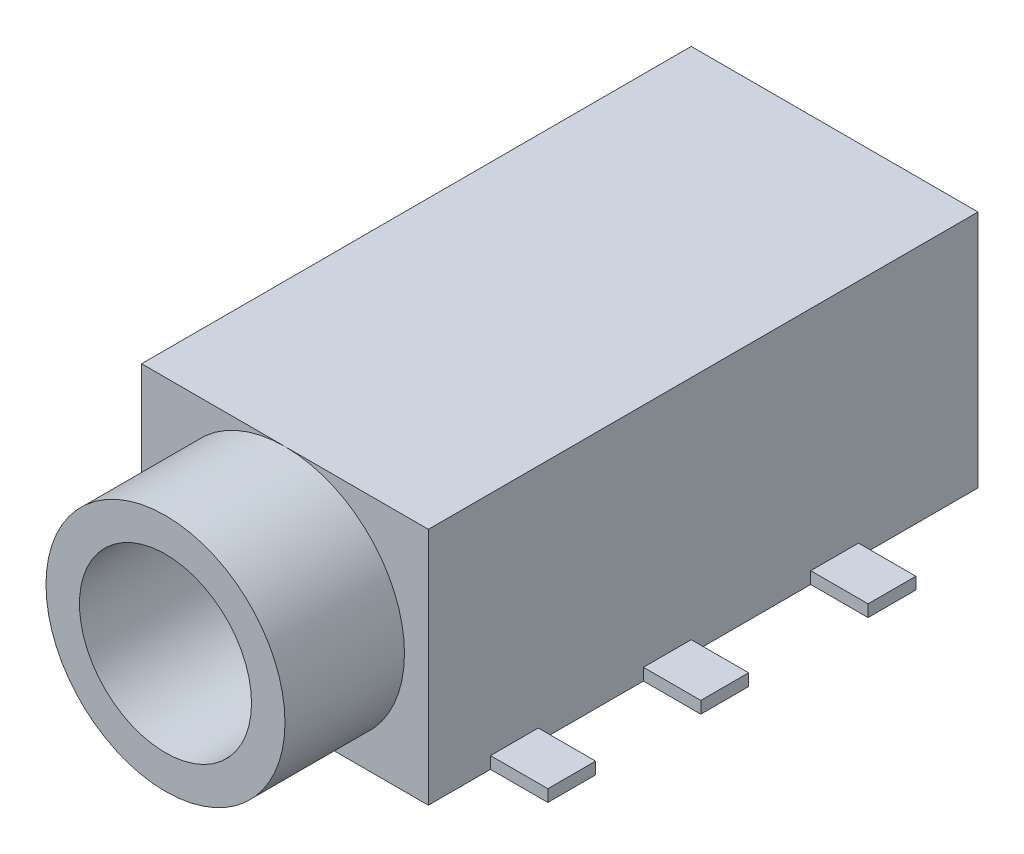
ISO-10303-21;
HEADER;
FILE_DESCRIPTION(('STEP AP214'),'2;1');
FILE_NAME('part.step','',(''),(''),'','','');
FILE_SCHEMA(('AUTOMOTIVE_DESIGN { 1 0 10303 214 1 1 1 1 }'));
ENDSEC;
DATA;
#1=APPLICATION_CONTEXT('core data for automotive mechanical design processes');
#2=APPLICATION_PROTOCOL_DEFINITION('international standard','automotive_design',2000,#1);
#3=PRODUCT_CONTEXT('',#1,'mechanical');
#4=PRODUCT('Part','Part','',(#3));
#5=PRODUCT_RELATED_PRODUCT_CATEGORY('part','',(#4));
#6=PRODUCT_DEFINITION_FORMATION('','',#4);
#7=PRODUCT_DEFINITION_CONTEXT('part definition',#1,'design');
#8=PRODUCT_DEFINITION('design','',#6,#7);
#9=PRODUCT_DEFINITION_SHAPE('','',#8);
#10=(LENGTH_UNIT() NAMED_UNIT(*) SI_UNIT(.MILLI.,.METRE.));
#11=(NAMED_UNIT(*) PLANE_ANGLE_UNIT() SI_UNIT($,.RADIAN.));
#12=(NAMED_UNIT(*) SI_UNIT($,.STERADIAN.) SOLID_ANGLE_UNIT());
#13=UNCERTAINTY_MEASURE_WITH_UNIT(LENGTH_MEASURE(1.E-05),#10,'distance_accuracy_value','');
#14=(GEOMETRIC_REPRESENTATION_CONTEXT(3) GLOBAL_UNCERTAINTY_ASSIGNED_CONTEXT((#13)) GLOBAL_UNIT_ASSIGNED_CONTEXT((#10,
#11,#12)) REPRESENTATION_CONTEXT('',''));
#15=CARTESIAN_POINT('',(0.,0.,0.));
#16=DIRECTION('',(0.,0.,1.));
#17=DIRECTION('',(1.,0.,0.));
#18=AXIS2_PLACEMENT_3D('',#15,#16,#17);
#19=CARTESIAN_POINT('',(3.,5.,0.));
#20=DIRECTION('',(-1.,0.,0.));
#21=DIRECTION('',(0.,0.,1.));
#22=AXIS2_PLACEMENT_3D('',#19,#20,#21);
#23=PLANE('',#22);
#24=DIRECTION('',(0.,-1.,0.));
#25=VECTOR('',#24,1.);
#26=CARTESIAN_POINT('',(3.,0.,-8.));
#27=LINE('',#26,#25);
#28=CARTESIAN_POINT('',(3.,0.250000000000001,-8.));
#29=VERTEX_POINT('',#28);
#30=CARTESIAN_POINT('',(3.,0.,-8.));
#31=VERTEX_POINT('',#30);
#32=EDGE_CURVE('E325',#29,#31,#27,.T.);
#33=ORIENTED_EDGE('',*,*,#32,.F.);
#34=DIRECTION('',(0.,0.,1.));
#35=VECTOR('',#34,1.);
#36=CARTESIAN_POINT('',(3.,0.25,-8.));
#37=LINE('',#36,#35);
#38=CARTESIAN_POINT('',(3.,0.250000000000001,-9.));
#39=VERTEX_POINT('',#38);
#40=EDGE_CURVE('E330',#39,#29,#37,.T.);
#41=ORIENTED_EDGE('',*,*,#40,.F.);
#42=DIRECTION('',(0.,1.,0.));
#43=VECTOR('',#42,1.);
#44=CARTESIAN_POINT('',(3.,0.,-9.));
#45=LINE('',#44,#43);
#46=CARTESIAN_POINT('',(3.,0.,-9.));
#47=VERTEX_POINT('',#46);
#48=EDGE_CURVE('E339',#47,#39,#45,.T.);
#49=ORIENTED_EDGE('',*,*,#48,.F.);
#50=DIRECTION('',(0.,0.,-1.));
#51=VECTOR('',#50,1.);
#52=CARTESIAN_POINT('',(3.,0.,0.));
#53=LINE('',#52,#51);
#54=CARTESIAN_POINT('',(3.,0.,-11.5));
#55=VERTEX_POINT('',#54);
#56=EDGE_CURVE('E429',#47,#55,#53,.T.);
#57=ORIENTED_EDGE('',*,*,#56,.T.);
#58=DIRECTION('',(0.,-1.,0.));
#59=VECTOR('',#58,1.);
#60=CARTESIAN_POINT('',(3.,5.,-11.5));
#61=LINE('',#60,#59);
#62=CARTESIAN_POINT('',(3.,5.,-11.5));
#63=VERTEX_POINT('',#62);
#64=EDGE_CURVE('E37',#63,#55,#61,.T.);
#65=ORIENTED_EDGE('',*,*,#64,.F.);
#66=DIRECTION('',(0.,0.,-1.));
#67=VECTOR('',#66,1.);
#68=CARTESIAN_POINT('',(3.,5.,0.));
#69=LINE('',#68,#67);
#70=CARTESIAN_POINT('',(3.,5.,0.));
#71=VERTEX_POINT('',#70);
#72=EDGE_CURVE('E432',#71,#63,#69,.T.);
#73=ORIENTED_EDGE('',*,*,#72,.F.);
#74=DIRECTION('',(0.,-1.,0.));
#75=VECTOR('',#74,1.);
#76=CARTESIAN_POINT('',(3.,5.,0.));
#77=LINE('',#76,#75);
#78=CARTESIAN_POINT('',(3.,0.,0.));
#79=VERTEX_POINT('',#78);
#80=EDGE_CURVE('E443',#71,#79,#77,.T.);
#81=ORIENTED_EDGE('',*,*,#80,.T.);
#82=CARTESIAN_POINT('',(3.,0.,-1.3));
#83=VERTEX_POINT('',#82);
#84=EDGE_CURVE('E444',#79,#83,#53,.T.);
#85=ORIENTED_EDGE('',*,*,#84,.T.);
#86=DIRECTION('',(0.,-1.,0.));
#87=VECTOR('',#86,1.);
#88=CARTESIAN_POINT('',(3.,0.,-1.3));
#89=LINE('',#88,#87);
#90=CARTESIAN_POINT('',(3.,0.25,-1.3));
#91=VERTEX_POINT('',#90);
#92=EDGE_CURVE('E385',#91,#83,#89,.T.);
#93=ORIENTED_EDGE('',*,*,#92,.F.);
#94=DIRECTION('',(0.,0.,1.));
#95=VECTOR('',#94,1.);
#96=CARTESIAN_POINT('',(3.,0.25,-1.3));
#97=LINE('',#96,#95);
#98=CARTESIAN_POINT('',(3.,0.25,-2.3));
#99=VERTEX_POINT('',#98);
#100=EDGE_CURVE('E390',#99,#91,#97,.T.);
#101=ORIENTED_EDGE('',*,*,#100,.F.);
#102=DIRECTION('',(0.,1.,0.));
#103=VECTOR('',#102,1.);
#104=CARTESIAN_POINT('',(3.,0.,-2.3));
#105=LINE('',#104,#103);
#106=CARTESIAN_POINT('',(3.,0.,-2.3));
#107=VERTEX_POINT('',#106);
#108=EDGE_CURVE('E399',#107,#99,#105,.T.);
#109=ORIENTED_EDGE('',*,*,#108,.F.);
#110=CARTESIAN_POINT('',(3.,0.,-4.5));
#111=VERTEX_POINT('',#110);
#112=EDGE_CURVE('E447',#107,#111,#53,.T.);
#113=ORIENTED_EDGE('',*,*,#112,.T.);
#114=DIRECTION('',(0.,-1.,0.));
#115=VECTOR('',#114,1.);
#116=CARTESIAN_POINT('',(3.,0.,-4.5));
#117=LINE('',#116,#115);
#118=CARTESIAN_POINT('',(3.,0.25,-4.5));
#119=VERTEX_POINT('',#118);
#120=EDGE_CURVE('E355',#119,#111,#117,.T.);
#121=ORIENTED_EDGE('',*,*,#120,.F.);
#122=DIRECTION('',(0.,0.,1.));
#123=VECTOR('',#122,1.);
#124=CARTESIAN_POINT('',(3.,0.25,-4.5));
#125=LINE('',#124,#123);
#126=CARTESIAN_POINT('',(3.,0.25,-5.5));
#127=VERTEX_POINT('',#126);
#128=EDGE_CURVE('E360',#127,#119,#125,.T.);
#129=ORIENTED_EDGE('',*,*,#128,.F.);
#130=DIRECTION('',(0.,1.,0.));
#131=VECTOR('',#130,1.);
#132=CARTESIAN_POINT('',(3.,0.,-5.5));
#133=LINE('',#132,#131);
#134=CARTESIAN_POINT('',(3.,0.,-5.5));
#135=VERTEX_POINT('',#134);
#136=EDGE_CURVE('E369',#135,#127,#133,.T.);
#137=ORIENTED_EDGE('',*,*,#136,.F.);
#138=EDGE_CURVE('E475',#135,#31,#53,.T.);
#139=ORIENTED_EDGE('',*,*,#138,.T.);
#140=EDGE_LOOP('',(#33,#41,#49,#57,#65,#73,#81,#85,#93,#101,#109,#113,#121,#129,#137,#139));
#141=FACE_BOUND('',#140,.T.);
#142=ADVANCED_FACE('F34',(#141),#23,.F.);
#143=CARTESIAN_POINT('',(-3.,5.,0.));
#144=DIRECTION('',(0.,0.,-1.));
#145=DIRECTION('',(-1.,0.,0.));
#146=AXIS2_PLACEMENT_3D('',#143,#144,#145);
#147=PLANE('',#146);
#148=CARTESIAN_POINT('',(0.,2.5,0.));
#149=DIRECTION('',(0.,0.,1.));
#150=DIRECTION('',(1.,0.,0.));
#151=AXIS2_PLACEMENT_3D('',#148,#149,#150);
#152=CIRCLE('',#151,2.5);
#153=CARTESIAN_POINT('',(0.,5.,0.));
#154=VERTEX_POINT('',#153);
#155=CARTESIAN_POINT('',(0.,0.,0.));
#156=VERTEX_POINT('',#155);
#157=EDGE_CURVE('E43',#154,#156,#152,.T.);
#158=ORIENTED_EDGE('',*,*,#157,.F.);
#159=DIRECTION('',(1.,0.,0.));
#160=VECTOR('',#159,1.);
#161=CARTESIAN_POINT('',(-3.,5.,0.));
#162=LINE('',#161,#160);
#163=CARTESIAN_POINT('',(-3.,5.,0.));
#164=VERTEX_POINT('',#163);
#165=EDGE_CURVE('E441',#164,#154,#162,.T.);
#166=ORIENTED_EDGE('',*,*,#165,.F.);
#167=DIRECTION('',(0.,-1.,0.));
#168=VECTOR('',#167,1.);
#169=CARTESIAN_POINT('',(-3.,5.,0.));
#170=LINE('',#169,#168);
#171=CARTESIAN_POINT('',(-3.,0.,0.));
#172=VERTEX_POINT('',#171);
#173=EDGE_CURVE('E458',#164,#172,#170,.T.);
#174=ORIENTED_EDGE('',*,*,#173,.T.);
#175=DIRECTION('',(1.,0.,0.));
#176=VECTOR('',#175,1.);
#177=CARTESIAN_POINT('',(-3.,0.,0.));
#178=LINE('',#177,#176);
#179=EDGE_CURVE('E436',#172,#156,#178,.T.);
#180=ORIENTED_EDGE('',*,*,#179,.T.);
#181=EDGE_LOOP('',(#158,#166,#174,#180));
#182=FACE_BOUND('',#181,.T.);
#183=ADVANCED_FACE('F489',(#182),#147,.F.);
#184=CARTESIAN_POINT('',(-3.,5.,-11.5));
#185=DIRECTION('',(0.,0.,1.));
#186=DIRECTION('',(1.,0.,0.));
#187=AXIS2_PLACEMENT_3D('',#184,#185,#186);
#188=PLANE('',#187);
#189=CARTESIAN_POINT('',(0.,2.5,-11.5));
#190=DIRECTION('',(0.,0.,1.));
#191=DIRECTION('',(1.,0.,0.));
#192=AXIS2_PLACEMENT_3D('',#189,#190,#191);
#193=CIRCLE('',#192,1.8);
#194=CARTESIAN_POINT('',(1.8,2.5,-11.5));
#195=VERTEX_POINT('',#194);
#196=EDGE_CURVE('E256',#195,#195,#193,.T.);
#197=ORIENTED_EDGE('',*,*,#196,.T.);
#198=EDGE_LOOP('',(#197));
#199=FACE_BOUND('',#198,.T.);
#200=DIRECTION('',(-1.,0.,0.));
#201=VECTOR('',#200,1.);
#202=CARTESIAN_POINT('',(-3.,0.,-11.5));
#203=LINE('',#202,#201);
#204=CARTESIAN_POINT('',(-3.,0.,-11.5));
#205=VERTEX_POINT('',#204);
#206=EDGE_CURVE('E446',#55,#205,#203,.T.);
#207=ORIENTED_EDGE('',*,*,#206,.T.);
#208=DIRECTION('',(0.,-1.,0.));
#209=VECTOR('',#208,1.);
#210=CARTESIAN_POINT('',(-3.,5.,-11.5));
#211=LINE('',#210,#209);
#212=CARTESIAN_POINT('',(-3.,5.,-11.5));
#213=VERTEX_POINT('',#212);
#214=EDGE_CURVE('E460',#213,#205,#211,.T.);
#215=ORIENTED_EDGE('',*,*,#214,.F.);
#216=DIRECTION('',(-1.,0.,0.));
#217=VECTOR('',#216,1.);
#218=CARTESIAN_POINT('',(-3.,5.,-11.5));
#219=LINE('',#218,#217);
#220=EDGE_CURVE('E435',#63,#213,#219,.T.);
#221=ORIENTED_EDGE('',*,*,#220,.F.);
#222=ORIENTED_EDGE('',*,*,#64,.T.);
#223=EDGE_LOOP('',(#207,#215,#221,#222));
#224=FACE_BOUND('',#223,.T.);
#225=ADVANCED_FACE('F468',(#199,#224),#188,.F.);
#226=CARTESIAN_POINT('',(-3.,5.,0.));
#227=DIRECTION('',(1.,0.,0.));
#228=DIRECTION('',(0.,0.,-1.));
#229=AXIS2_PLACEMENT_3D('',#226,#227,#228);
#230=PLANE('',#229);
#231=DIRECTION('',(0.,0.,1.));
#232=VECTOR('',#231,1.);
#233=CARTESIAN_POINT('',(-3.,0.25,-8.));
#234=LINE('',#233,#232);
#235=CARTESIAN_POINT('',(-3.,0.25,-9.));
#236=VERTEX_POINT('',#235);
#237=CARTESIAN_POINT('',(-3.,0.250000000000001,-8.));
#238=VERTEX_POINT('',#237);
#239=EDGE_CURVE('E50',#236,#238,#234,.T.);
#240=ORIENTED_EDGE('',*,*,#239,.T.);
#241=DIRECTION('',(0.,-1.,0.));
#242=VECTOR('',#241,1.);
#243=CARTESIAN_POINT('',(-3.,0.,-8.));
#244=LINE('',#243,#242);
#245=CARTESIAN_POINT('',(-3.,0.,-8.));
#246=VERTEX_POINT('',#245);
#247=EDGE_CURVE('E232',#238,#246,#244,.T.);
#248=ORIENTED_EDGE('',*,*,#247,.T.);
#249=DIRECTION('',(0.,0.,1.));
#250=VECTOR('',#249,1.);
#251=CARTESIAN_POINT('',(-3.,0.,0.));
#252=LINE('',#251,#250);
#253=CARTESIAN_POINT('',(-3.,0.,-5.5));
#254=VERTEX_POINT('',#253);
#255=EDGE_CURVE('E453',#246,#254,#252,.T.);
#256=ORIENTED_EDGE('',*,*,#255,.T.);
#257=DIRECTION('',(0.,1.,0.));
#258=VECTOR('',#257,1.);
#259=CARTESIAN_POINT('',(-3.,0.,-5.5));
#260=LINE('',#259,#258);
#261=CARTESIAN_POINT('',(-3.,0.25,-5.5));
#262=VERTEX_POINT('',#261);
#263=EDGE_CURVE('E268',#254,#262,#260,.T.);
#264=ORIENTED_EDGE('',*,*,#263,.T.);
#265=DIRECTION('',(0.,0.,1.));
#266=VECTOR('',#265,1.);
#267=CARTESIAN_POINT('',(-3.,0.25,-4.5));
#268=LINE('',#267,#266);
#269=CARTESIAN_POINT('',(-3.,0.25,-4.5));
#270=VERTEX_POINT('',#269);
#271=EDGE_CURVE('E280',#262,#270,#268,.T.);
#272=ORIENTED_EDGE('',*,*,#271,.T.);
#273=DIRECTION('',(0.,-1.,0.));
#274=VECTOR('',#273,1.);
#275=CARTESIAN_POINT('',(-3.,0.,-4.5));
#276=LINE('',#275,#274);
#277=CARTESIAN_POINT('',(-3.,0.,-4.5));
#278=VERTEX_POINT('',#277);
#279=EDGE_CURVE('E235',#270,#278,#276,.T.);
#280=ORIENTED_EDGE('',*,*,#279,.T.);
#281=CARTESIAN_POINT('',(-3.,0.,-2.3));
#282=VERTEX_POINT('',#281);
#283=EDGE_CURVE('E664',#278,#282,#252,.T.);
#284=ORIENTED_EDGE('',*,*,#283,.T.);
#285=DIRECTION('',(0.,1.,0.));
#286=VECTOR('',#285,1.);
#287=CARTESIAN_POINT('',(-3.,0.,-2.3));
#288=LINE('',#287,#286);
#289=CARTESIAN_POINT('',(-3.,0.25,-2.3));
#290=VERTEX_POINT('',#289);
#291=EDGE_CURVE('E299',#282,#290,#288,.T.);
#292=ORIENTED_EDGE('',*,*,#291,.T.);
#293=DIRECTION('',(0.,0.,1.));
#294=VECTOR('',#293,1.);
#295=CARTESIAN_POINT('',(-3.,0.25,-1.3));
#296=LINE('',#295,#294);
#297=CARTESIAN_POINT('',(-3.,0.25,-1.3));
#298=VERTEX_POINT('',#297);
#299=EDGE_CURVE('E311',#290,#298,#296,.T.);
#300=ORIENTED_EDGE('',*,*,#299,.T.);
#301=DIRECTION('',(0.,-1.,0.));
#302=VECTOR('',#301,1.);
#303=CARTESIAN_POINT('',(-3.,0.,-1.3));
#304=LINE('',#303,#302);
#305=CARTESIAN_POINT('',(-3.,0.,-1.3));
#306=VERTEX_POINT('',#305);
#307=EDGE_CURVE('E294',#298,#306,#304,.T.);
#308=ORIENTED_EDGE('',*,*,#307,.T.);
#309=EDGE_CURVE('E449',#306,#172,#252,.T.);
#310=ORIENTED_EDGE('',*,*,#309,.T.);
#311=ORIENTED_EDGE('',*,*,#173,.F.);
#312=DIRECTION('',(0.,0.,1.));
#313=VECTOR('',#312,1.);
#314=CARTESIAN_POINT('',(-3.,5.,0.));
#315=LINE('',#314,#313);
#316=EDGE_CURVE('E438',#213,#164,#315,.T.);
#317=ORIENTED_EDGE('',*,*,#316,.F.);
#318=ORIENTED_EDGE('',*,*,#214,.T.);
#319=CARTESIAN_POINT('',(-3.,0.,-9.));
#320=VERTEX_POINT('',#319);
#321=EDGE_CURVE('E450',#205,#320,#252,.T.);
#322=ORIENTED_EDGE('',*,*,#321,.T.);
#323=DIRECTION('',(0.,1.,0.));
#324=VECTOR('',#323,1.);
#325=CARTESIAN_POINT('',(-3.,0.,-9.));
#326=LINE('',#325,#324);
#327=EDGE_CURVE('E55',#320,#236,#326,.T.);
#328=ORIENTED_EDGE('',*,*,#327,.T.);
#329=EDGE_LOOP('',(#240,#248,#256,#264,#272,#280,#284,#292,#300,#308,#310,#311,#317,#318,#322,#328));
#330=FACE_BOUND('',#329,.T.);
#331=ADVANCED_FACE('F478',(#330),#230,.F.);
#332=EDGE_CURVE('E11',#156,#154,#152,.T.);
#333=ORIENTED_EDGE('',*,*,#332,.F.);
#334=EDGE_CURVE('E452',#156,#79,#178,.T.);
#335=ORIENTED_EDGE('',*,*,#334,.T.);
#336=ORIENTED_EDGE('',*,*,#80,.F.);
#337=EDGE_CURVE('E440',#154,#71,#162,.T.);
#338=ORIENTED_EDGE('',*,*,#337,.F.);
#339=EDGE_LOOP('',(#333,#335,#336,#338));
#340=FACE_BOUND('',#339,.T.);
#341=ADVANCED_FACE('F480',(#340),#147,.F.);
#342=CARTESIAN_POINT('',(0.,5.,0.));
#343=DIRECTION('',(0.,-1.,0.));
#344=DIRECTION('',(0.,0.,-1.));
#345=AXIS2_PLACEMENT_3D('',#342,#343,#344);
#346=PLANE('',#345);
#347=ORIENTED_EDGE('',*,*,#72,.T.);
#348=ORIENTED_EDGE('',*,*,#220,.T.);
#349=ORIENTED_EDGE('',*,*,#316,.T.);
#350=ORIENTED_EDGE('',*,*,#165,.T.);
#351=ORIENTED_EDGE('',*,*,#337,.T.);
#352=EDGE_LOOP('',(#347,#348,#349,#350,#351));
#353=FACE_BOUND('',#352,.T.);
#354=ADVANCED_FACE('F486',(#353),#346,.F.);
#355=CARTESIAN_POINT('',(0.,0.,0.));
#356=DIRECTION('',(0.,-1.,0.));
#357=DIRECTION('',(0.,0.,-1.));
#358=AXIS2_PLACEMENT_3D('',#355,#356,#357);
#359=PLANE('',#358);
#360=CARTESIAN_POINT('',(0.,0.,-8.5));
#361=DIRECTION('',(0.,-1.,0.));
#362=DIRECTION('',(0.,0.,-1.));
#363=AXIS2_PLACEMENT_3D('',#360,#361,#362);
#364=CIRCLE('',#363,0.75);
#365=CARTESIAN_POINT('',(0.,0.,-9.25));
#366=VERTEX_POINT('',#365);
#367=EDGE_CURVE('E415',#366,#366,#364,.T.);
#368=ORIENTED_EDGE('',*,*,#367,.F.);
#369=EDGE_LOOP('',(#368));
#370=FACE_BOUND('',#369,.T.);
#371=CARTESIAN_POINT('',(0.,0.,-2.5));
#372=DIRECTION('',(0.,-1.,0.));
#373=DIRECTION('',(0.,0.,-1.));
#374=AXIS2_PLACEMENT_3D('',#371,#372,#373);
#375=CIRCLE('',#374,0.75);
#376=CARTESIAN_POINT('',(0.,0.,-3.25));
#377=VERTEX_POINT('',#376);
#378=EDGE_CURVE('E419',#377,#377,#375,.T.);
#379=ORIENTED_EDGE('',*,*,#378,.F.);
#380=EDGE_LOOP('',(#379));
#381=FACE_BOUND('',#380,.T.);
#382=ORIENTED_EDGE('',*,*,#84,.F.);
#383=ORIENTED_EDGE('',*,*,#334,.F.);
#384=ORIENTED_EDGE('',*,*,#179,.F.);
#385=ORIENTED_EDGE('',*,*,#309,.F.);
#386=DIRECTION('',(1.,0.,0.));
#387=VECTOR('',#386,1.);
#388=CARTESIAN_POINT('',(-4.2,0.,-1.3));
#389=LINE('',#388,#387);
#390=CARTESIAN_POINT('',(-4.2,0.,-1.3));
#391=VERTEX_POINT('',#390);
#392=EDGE_CURVE('E308',#391,#306,#389,.T.);
#393=ORIENTED_EDGE('',*,*,#392,.F.);
#394=DIRECTION('',(0.,0.,-1.));
#395=VECTOR('',#394,1.);
#396=CARTESIAN_POINT('',(-4.2,0.,-1.3));
#397=LINE('',#396,#395);
#398=CARTESIAN_POINT('',(-4.2,0.,-2.3));
#399=VERTEX_POINT('',#398);
#400=EDGE_CURVE('E305',#391,#399,#397,.T.);
#401=ORIENTED_EDGE('',*,*,#400,.T.);
#402=DIRECTION('',(1.,0.,0.));
#403=VECTOR('',#402,1.);
#404=CARTESIAN_POINT('',(-4.2,0.,-2.3));
#405=LINE('',#404,#403);
#406=EDGE_CURVE('E317',#399,#282,#405,.T.);
#407=ORIENTED_EDGE('',*,*,#406,.T.);
#408=ORIENTED_EDGE('',*,*,#283,.F.);
#409=DIRECTION('',(1.,0.,0.));
#410=VECTOR('',#409,1.);
#411=CARTESIAN_POINT('',(-4.2,0.,-4.5));
#412=LINE('',#411,#410);
#413=CARTESIAN_POINT('',(-4.2,0.,-4.5));
#414=VERTEX_POINT('',#413);
#415=EDGE_CURVE('E277',#414,#278,#412,.T.);
#416=ORIENTED_EDGE('',*,*,#415,.F.);
#417=DIRECTION('',(0.,0.,-1.));
#418=VECTOR('',#417,1.);
#419=CARTESIAN_POINT('',(-4.2,0.,-4.5));
#420=LINE('',#419,#418);
#421=CARTESIAN_POINT('',(-4.2,0.,-5.5));
#422=VERTEX_POINT('',#421);
#423=EDGE_CURVE('E274',#414,#422,#420,.T.);
#424=ORIENTED_EDGE('',*,*,#423,.T.);
#425=DIRECTION('',(1.,0.,0.));
#426=VECTOR('',#425,1.);
#427=CARTESIAN_POINT('',(-4.2,0.,-5.5));
#428=LINE('',#427,#426);
#429=EDGE_CURVE('E285',#422,#254,#428,.T.);
#430=ORIENTED_EDGE('',*,*,#429,.T.);
#431=ORIENTED_EDGE('',*,*,#255,.F.);
#432=DIRECTION('',(1.,0.,0.));
#433=VECTOR('',#432,1.);
#434=CARTESIAN_POINT('',(-4.2,0.,-8.));
#435=LINE('',#434,#433);
#436=CARTESIAN_POINT('',(-4.2,0.,-8.));
#437=VERTEX_POINT('',#436);
#438=EDGE_CURVE('E254',#437,#246,#435,.T.);
#439=ORIENTED_EDGE('',*,*,#438,.F.);
#440=DIRECTION('',(0.,0.,-1.));
#441=VECTOR('',#440,1.);
#442=CARTESIAN_POINT('',(-4.2,0.,-8.));
#443=LINE('',#442,#441);
#444=CARTESIAN_POINT('',(-4.2,0.,-9.));
#445=VERTEX_POINT('',#444);
#446=EDGE_CURVE('E245',#437,#445,#443,.T.);
#447=ORIENTED_EDGE('',*,*,#446,.T.);
#448=DIRECTION('',(1.,0.,0.));
#449=VECTOR('',#448,1.);
#450=CARTESIAN_POINT('',(-4.2,0.,-9.));
#451=LINE('',#450,#449);
#452=EDGE_CURVE('E260',#445,#320,#451,.T.);
#453=ORIENTED_EDGE('',*,*,#452,.T.);
#454=ORIENTED_EDGE('',*,*,#321,.F.);
#455=ORIENTED_EDGE('',*,*,#206,.F.);
#456=ORIENTED_EDGE('',*,*,#56,.F.);
#457=DIRECTION('',(-1.,0.,0.));
#458=VECTOR('',#457,1.);
#459=CARTESIAN_POINT('',(4.2,0.,-9.));
#460=LINE('',#459,#458);
#461=CARTESIAN_POINT('',(4.2,0.,-9.));
#462=VERTEX_POINT('',#461);
#463=EDGE_CURVE('E349',#462,#47,#460,.T.);
#464=ORIENTED_EDGE('',*,*,#463,.F.);
#465=DIRECTION('',(0.,0.,-1.));
#466=VECTOR('',#465,1.);
#467=CARTESIAN_POINT('',(4.2,0.,-8.));
#468=LINE('',#467,#466);
#469=CARTESIAN_POINT('',(4.2,0.,-8.));
#470=VERTEX_POINT('',#469);
#471=EDGE_CURVE('E329',#470,#462,#468,.T.);
#472=ORIENTED_EDGE('',*,*,#471,.F.);
#473=DIRECTION('',(-1.,0.,0.));
#474=VECTOR('',#473,1.);
#475=CARTESIAN_POINT('',(4.2,0.,-8.));
#476=LINE('',#475,#474);
#477=EDGE_CURVE('E352',#470,#31,#476,.T.);
#478=ORIENTED_EDGE('',*,*,#477,.T.);
#479=ORIENTED_EDGE('',*,*,#138,.F.);
#480=DIRECTION('',(-1.,0.,0.));
#481=VECTOR('',#480,1.);
#482=CARTESIAN_POINT('',(4.2,0.,-5.5));
#483=LINE('',#482,#481);
#484=CARTESIAN_POINT('',(4.2,0.,-5.5));
#485=VERTEX_POINT('',#484);
#486=EDGE_CURVE('E379',#485,#135,#483,.T.);
#487=ORIENTED_EDGE('',*,*,#486,.F.);
#488=DIRECTION('',(0.,0.,-1.));
#489=VECTOR('',#488,1.);
#490=CARTESIAN_POINT('',(4.2,0.,-4.5));
#491=LINE('',#490,#489);
#492=CARTESIAN_POINT('',(4.2,0.,-4.5));
#493=VERTEX_POINT('',#492);
#494=EDGE_CURVE('E359',#493,#485,#491,.T.);
#495=ORIENTED_EDGE('',*,*,#494,.F.);
#496=DIRECTION('',(-1.,0.,0.));
#497=VECTOR('',#496,1.);
#498=CARTESIAN_POINT('',(4.2,0.,-4.5));
#499=LINE('',#498,#497);
#500=EDGE_CURVE('E382',#493,#111,#499,.T.);
#501=ORIENTED_EDGE('',*,*,#500,.T.);
#502=ORIENTED_EDGE('',*,*,#112,.F.);
#503=DIRECTION('',(-1.,0.,0.));
#504=VECTOR('',#503,1.);
#505=CARTESIAN_POINT('',(4.2,0.,-2.3));
#506=LINE('',#505,#504);
#507=CARTESIAN_POINT('',(4.2,0.,-2.3));
#508=VERTEX_POINT('',#507);
#509=EDGE_CURVE('E409',#508,#107,#506,.T.);
#510=ORIENTED_EDGE('',*,*,#509,.F.);
#511=DIRECTION('',(0.,0.,-1.));
#512=VECTOR('',#511,1.);
#513=CARTESIAN_POINT('',(4.2,0.,-1.3));
#514=LINE('',#513,#512);
#515=CARTESIAN_POINT('',(4.2,0.,-1.3));
#516=VERTEX_POINT('',#515);
#517=EDGE_CURVE('E389',#516,#508,#514,.T.);
#518=ORIENTED_EDGE('',*,*,#517,.F.);
#519=DIRECTION('',(-1.,0.,0.));
#520=VECTOR('',#519,1.);
#521=CARTESIAN_POINT('',(4.2,0.,-1.3));
#522=LINE('',#521,#520);
#523=EDGE_CURVE('E412',#516,#83,#522,.T.);
#524=ORIENTED_EDGE('',*,*,#523,.T.);
#525=EDGE_LOOP('',(#382,#383,#384,#385,#393,#401,#407,#408,#416,#424,#430,#431,#439,#447,#453,
#454,#455,#456,#464,#472,#478,#479,#487,#495,#501,#502,#510,#518,#524));
#526=FACE_BOUND('',#525,.T.);
#527=ADVANCED_FACE('F477',(#370,#381,#526),#359,.T.);
#528=CARTESIAN_POINT('',(0.,2.5,2.5));
#529=DIRECTION('',(0.,0.,-1.));
#530=DIRECTION('',(-1.,0.,0.));
#531=AXIS2_PLACEMENT_3D('',#528,#529,#530);
#532=CYLINDRICAL_SURFACE('',#531,2.5);
#533=CARTESIAN_POINT('',(0.,2.5,2.5));
#534=DIRECTION('',(0.,0.,1.));
#535=DIRECTION('',(1.,0.,0.));
#536=AXIS2_PLACEMENT_3D('',#533,#534,#535);
#537=CIRCLE('',#536,2.5);
#538=CARTESIAN_POINT('',(2.5,2.5,2.5));
#539=VERTEX_POINT('',#538);
#540=EDGE_CURVE('E427',#539,#539,#537,.T.);
#541=ORIENTED_EDGE('',*,*,#540,.F.);
#542=EDGE_LOOP('',(#541));
#543=FACE_BOUND('',#542,.T.);
#544=ORIENTED_EDGE('',*,*,#157,.T.);
#545=ORIENTED_EDGE('',*,*,#332,.T.);
#546=EDGE_LOOP('',(#544,#545));
#547=FACE_BOUND('',#546,.T.);
#548=ADVANCED_FACE('F502',(#543,#547),#532,.T.);
#549=CARTESIAN_POINT('',(0.,2.5,2.5));
#550=DIRECTION('',(0.,0.,1.));
#551=DIRECTION('',(1.,0.,0.));
#552=AXIS2_PLACEMENT_3D('',#549,#550,#551);
#553=PLANE('',#552);
#554=CARTESIAN_POINT('',(0.,2.5,2.5));
#555=DIRECTION('',(0.,0.,1.));
#556=DIRECTION('',(1.,0.,0.));
#557=AXIS2_PLACEMENT_3D('',#554,#555,#556);
#558=CIRCLE('',#557,1.8);
#559=CARTESIAN_POINT('',(1.8,2.5,2.5));
#560=VERTEX_POINT('',#559);
#561=EDGE_CURVE('E630',#560,#560,#558,.T.);
#562=ORIENTED_EDGE('',*,*,#561,.F.);
#563=EDGE_LOOP('',(#562));
#564=FACE_BOUND('',#563,.T.);
#565=ORIENTED_EDGE('',*,*,#540,.T.);
#566=EDGE_LOOP('',(#565));
#567=FACE_BOUND('',#566,.T.);
#568=ADVANCED_FACE('F509',(#564,#567),#553,.T.);
#569=CARTESIAN_POINT('',(0.,-0.5,-2.5));
#570=DIRECTION('',(0.,1.,0.));
#571=DIRECTION('',(0.,0.,1.));
#572=AXIS2_PLACEMENT_3D('',#569,#570,#571);
#573=CYLINDRICAL_SURFACE('',#572,0.75);
#574=CARTESIAN_POINT('',(0.,-0.5,-2.5));
#575=DIRECTION('',(0.,-1.,0.));
#576=DIRECTION('',(0.,0.,-1.));
#577=AXIS2_PLACEMENT_3D('',#574,#575,#576);
#578=CIRCLE('',#577,0.75);
#579=CARTESIAN_POINT('',(0.,-0.5,-3.25));
#580=VERTEX_POINT('',#579);
#581=EDGE_CURVE('E422',#580,#580,#578,.T.);
#582=ORIENTED_EDGE('',*,*,#581,.F.);
#583=EDGE_LOOP('',(#582));
#584=FACE_BOUND('',#583,.T.);
#585=ORIENTED_EDGE('',*,*,#378,.T.);
#586=EDGE_LOOP('',(#585));
#587=FACE_BOUND('',#586,.T.);
#588=ADVANCED_FACE('F513',(#584,#587),#573,.T.);
#589=CARTESIAN_POINT('',(0.,-0.5,-2.5));
#590=DIRECTION('',(0.,-1.,0.));
#591=DIRECTION('',(0.,0.,-1.));
#592=AXIS2_PLACEMENT_3D('',#589,#590,#591);
#593=PLANE('',#592);
#594=ORIENTED_EDGE('',*,*,#581,.T.);
#595=EDGE_LOOP('',(#594));
#596=FACE_BOUND('',#595,.T.);
#597=ADVANCED_FACE('F517',(#596),#593,.T.);
#598=CARTESIAN_POINT('',(0.,-0.5,-8.5));
#599=DIRECTION('',(0.,1.,0.));
#600=DIRECTION('',(0.,0.,1.));
#601=AXIS2_PLACEMENT_3D('',#598,#599,#600);
#602=CYLINDRICAL_SURFACE('',#601,0.75);
#603=CARTESIAN_POINT('',(0.,-0.5,-8.5));
#604=DIRECTION('',(0.,-1.,0.));
#605=DIRECTION('',(0.,0.,-1.));
#606=AXIS2_PLACEMENT_3D('',#603,#604,#605);
#607=CIRCLE('',#606,0.75);
#608=CARTESIAN_POINT('',(0.,-0.5,-9.25));
#609=VERTEX_POINT('',#608);
#610=EDGE_CURVE('E416',#609,#609,#607,.T.);
#611=ORIENTED_EDGE('',*,*,#610,.F.);
#612=EDGE_LOOP('',(#611));
#613=FACE_BOUND('',#612,.T.);
#614=ORIENTED_EDGE('',*,*,#367,.T.);
#615=EDGE_LOOP('',(#614));
#616=FACE_BOUND('',#615,.T.);
#617=ADVANCED_FACE('F521',(#613,#616),#602,.T.);
#618=CARTESIAN_POINT('',(0.,-0.5,-8.5));
#619=DIRECTION('',(0.,-1.,0.));
#620=DIRECTION('',(0.,0.,-1.));
#621=AXIS2_PLACEMENT_3D('',#618,#619,#620);
#622=PLANE('',#621);
#623=ORIENTED_EDGE('',*,*,#610,.T.);
#624=EDGE_LOOP('',(#623));
#625=FACE_BOUND('',#624,.T.);
#626=ADVANCED_FACE('F525',(#625),#622,.T.);
#627=CARTESIAN_POINT('',(4.2,0.,-1.3));
#628=DIRECTION('',(0.,0.,-1.));
#629=DIRECTION('',(-1.,0.,0.));
#630=AXIS2_PLACEMENT_3D('',#627,#628,#629);
#631=PLANE('',#630);
#632=ORIENTED_EDGE('',*,*,#92,.T.);
#633=ORIENTED_EDGE('',*,*,#523,.F.);
#634=DIRECTION('',(0.,-1.,0.));
#635=VECTOR('',#634,1.);
#636=CARTESIAN_POINT('',(4.2,0.,-1.3));
#637=LINE('',#636,#635);
#638=CARTESIAN_POINT('',(4.2,0.25,-1.3));
#639=VERTEX_POINT('',#638);
#640=EDGE_CURVE('E386',#639,#516,#637,.T.);
#641=ORIENTED_EDGE('',*,*,#640,.F.);
#642=DIRECTION('',(-1.,0.,0.));
#643=VECTOR('',#642,1.);
#644=CARTESIAN_POINT('',(4.2,0.25,-1.3));
#645=LINE('',#644,#643);
#646=EDGE_CURVE('E396',#639,#91,#645,.T.);
#647=ORIENTED_EDGE('',*,*,#646,.T.);
#648=EDGE_LOOP('',(#632,#633,#641,#647));
#649=FACE_BOUND('',#648,.T.);
#650=ADVANCED_FACE('F529',(#649),#631,.F.);
#651=CARTESIAN_POINT('',(4.2,0.,-2.3));
#652=DIRECTION('',(0.,0.,1.));
#653=DIRECTION('',(0.,-1.,0.));
#654=AXIS2_PLACEMENT_3D('',#651,#652,#653);
#655=PLANE('',#654);
#656=ORIENTED_EDGE('',*,*,#108,.T.);
#657=DIRECTION('',(-1.,0.,0.));
#658=VECTOR('',#657,1.);
#659=CARTESIAN_POINT('',(4.2,0.25,-2.3));
#660=LINE('',#659,#658);
#661=CARTESIAN_POINT('',(4.2,0.25,-2.3));
#662=VERTEX_POINT('',#661);
#663=EDGE_CURVE('E406',#662,#99,#660,.T.);
#664=ORIENTED_EDGE('',*,*,#663,.F.);
#665=DIRECTION('',(0.,1.,0.));
#666=VECTOR('',#665,1.);
#667=CARTESIAN_POINT('',(4.2,0.,-2.3));
#668=LINE('',#667,#666);
#669=EDGE_CURVE('E392',#508,#662,#668,.T.);
#670=ORIENTED_EDGE('',*,*,#669,.F.);
#671=ORIENTED_EDGE('',*,*,#509,.T.);
#672=EDGE_LOOP('',(#656,#664,#670,#671));
#673=FACE_BOUND('',#672,.T.);
#674=ADVANCED_FACE('F533',(#673),#655,.F.);
#675=CARTESIAN_POINT('',(4.2,0.25,-1.3));
#676=DIRECTION('',(0.,-1.,0.));
#677=DIRECTION('',(0.,0.,-1.));
#678=AXIS2_PLACEMENT_3D('',#675,#676,#677);
#679=PLANE('',#678);
#680=ORIENTED_EDGE('',*,*,#100,.T.);
#681=ORIENTED_EDGE('',*,*,#646,.F.);
#682=DIRECTION('',(0.,0.,1.));
#683=VECTOR('',#682,1.);
#684=CARTESIAN_POINT('',(4.2,0.25,-1.3));
#685=LINE('',#684,#683);
#686=EDGE_CURVE('E394',#662,#639,#685,.T.);
#687=ORIENTED_EDGE('',*,*,#686,.F.);
#688=ORIENTED_EDGE('',*,*,#663,.T.);
#689=EDGE_LOOP('',(#680,#681,#687,#688));
#690=FACE_BOUND('',#689,.T.);
#691=ADVANCED_FACE('F537',(#690),#679,.F.);
#692=CARTESIAN_POINT('',(4.2,0.,0.));
#693=DIRECTION('',(-1.,0.,0.));
#694=DIRECTION('',(0.,0.,1.));
#695=AXIS2_PLACEMENT_3D('',#692,#693,#694);
#696=PLANE('',#695);
#697=ORIENTED_EDGE('',*,*,#640,.T.);
#698=ORIENTED_EDGE('',*,*,#517,.T.);
#699=ORIENTED_EDGE('',*,*,#669,.T.);
#700=ORIENTED_EDGE('',*,*,#686,.T.);
#701=EDGE_LOOP('',(#697,#698,#699,#700));
#702=FACE_BOUND('',#701,.T.);
#703=ADVANCED_FACE('F541',(#702),#696,.F.);
#704=CARTESIAN_POINT('',(4.2,0.,-4.5));
#705=DIRECTION('',(0.,0.,-1.));
#706=DIRECTION('',(-1.,0.,0.));
#707=AXIS2_PLACEMENT_3D('',#704,#705,#706);
#708=PLANE('',#707);
#709=ORIENTED_EDGE('',*,*,#120,.T.);
#710=ORIENTED_EDGE('',*,*,#500,.F.);
#711=DIRECTION('',(0.,-1.,0.));
#712=VECTOR('',#711,1.);
#713=CARTESIAN_POINT('',(4.2,0.,-4.5));
#714=LINE('',#713,#712);
#715=CARTESIAN_POINT('',(4.2,0.25,-4.5));
#716=VERTEX_POINT('',#715);
#717=EDGE_CURVE('E356',#716,#493,#714,.T.);
#718=ORIENTED_EDGE('',*,*,#717,.F.);
#719=DIRECTION('',(-1.,0.,0.));
#720=VECTOR('',#719,1.);
#721=CARTESIAN_POINT('',(4.2,0.25,-4.5));
#722=LINE('',#721,#720);
#723=EDGE_CURVE('E366',#716,#119,#722,.T.);
#724=ORIENTED_EDGE('',*,*,#723,.T.);
#725=EDGE_LOOP('',(#709,#710,#718,#724));
#726=FACE_BOUND('',#725,.T.);
#727=ADVANCED_FACE('F545',(#726),#708,.F.);
#728=CARTESIAN_POINT('',(4.2,0.,-5.5));
#729=DIRECTION('',(0.,0.,1.));
#730=DIRECTION('',(1.,0.,0.));
#731=AXIS2_PLACEMENT_3D('',#728,#729,#730);
#732=PLANE('',#731);
#733=ORIENTED_EDGE('',*,*,#136,.T.);
#734=DIRECTION('',(-1.,0.,0.));
#735=VECTOR('',#734,1.);
#736=CARTESIAN_POINT('',(4.2,0.25,-5.5));
#737=LINE('',#736,#735);
#738=CARTESIAN_POINT('',(4.2,0.25,-5.5));
#739=VERTEX_POINT('',#738);
#740=EDGE_CURVE('E376',#739,#127,#737,.T.);
#741=ORIENTED_EDGE('',*,*,#740,.F.);
#742=DIRECTION('',(0.,1.,0.));
#743=VECTOR('',#742,1.);
#744=CARTESIAN_POINT('',(4.2,0.,-5.5));
#745=LINE('',#744,#743);
#746=EDGE_CURVE('E362',#485,#739,#745,.T.);
#747=ORIENTED_EDGE('',*,*,#746,.F.);
#748=ORIENTED_EDGE('',*,*,#486,.T.);
#749=EDGE_LOOP('',(#733,#741,#747,#748));
#750=FACE_BOUND('',#749,.T.);
#751=ADVANCED_FACE('F549',(#750),#732,.F.);
#752=CARTESIAN_POINT('',(4.2,0.25,-4.5));
#753=DIRECTION('',(0.,-1.,0.));
#754=DIRECTION('',(0.,0.,-1.));
#755=AXIS2_PLACEMENT_3D('',#752,#753,#754);
#756=PLANE('',#755);
#757=ORIENTED_EDGE('',*,*,#128,.T.);
#758=ORIENTED_EDGE('',*,*,#723,.F.);
#759=DIRECTION('',(0.,0.,1.));
#760=VECTOR('',#759,1.);
#761=CARTESIAN_POINT('',(4.2,0.25,-4.5));
#762=LINE('',#761,#760);
#763=EDGE_CURVE('E364',#739,#716,#762,.T.);
#764=ORIENTED_EDGE('',*,*,#763,.F.);
#765=ORIENTED_EDGE('',*,*,#740,.T.);
#766=EDGE_LOOP('',(#757,#758,#764,#765));
#767=FACE_BOUND('',#766,.T.);
#768=ADVANCED_FACE('F553',(#767),#756,.F.);
#769=CARTESIAN_POINT('',(4.2,0.,0.));
#770=DIRECTION('',(-1.,0.,0.));
#771=DIRECTION('',(0.,0.,1.));
#772=AXIS2_PLACEMENT_3D('',#769,#770,#771);
#773=PLANE('',#772);
#774=ORIENTED_EDGE('',*,*,#717,.T.);
#775=ORIENTED_EDGE('',*,*,#494,.T.);
#776=ORIENTED_EDGE('',*,*,#746,.T.);
#777=ORIENTED_EDGE('',*,*,#763,.T.);
#778=EDGE_LOOP('',(#774,#775,#776,#777));
#779=FACE_BOUND('',#778,.T.);
#780=ADVANCED_FACE('F557',(#779),#773,.F.);
#781=CARTESIAN_POINT('',(4.2,0.,-8.));
#782=DIRECTION('',(0.,0.,-1.));
#783=DIRECTION('',(-1.,0.,0.));
#784=AXIS2_PLACEMENT_3D('',#781,#782,#783);
#785=PLANE('',#784);
#786=ORIENTED_EDGE('',*,*,#32,.T.);
#787=ORIENTED_EDGE('',*,*,#477,.F.);
#788=DIRECTION('',(0.,-1.,0.));
#789=VECTOR('',#788,1.);
#790=CARTESIAN_POINT('',(4.2,0.,-8.));
#791=LINE('',#790,#789);
#792=CARTESIAN_POINT('',(4.2,0.25,-8.));
#793=VERTEX_POINT('',#792);
#794=EDGE_CURVE('E326',#793,#470,#791,.T.);
#795=ORIENTED_EDGE('',*,*,#794,.F.);
#796=DIRECTION('',(-1.,0.,0.));
#797=VECTOR('',#796,1.);
#798=CARTESIAN_POINT('',(4.2,0.25,-8.));
#799=LINE('',#798,#797);
#800=EDGE_CURVE('E336',#793,#29,#799,.T.);
#801=ORIENTED_EDGE('',*,*,#800,.T.);
#802=EDGE_LOOP('',(#786,#787,#795,#801));
#803=FACE_BOUND('',#802,.T.);
#804=ADVANCED_FACE('F561',(#803),#785,.F.);
#805=CARTESIAN_POINT('',(4.2,0.,-9.));
#806=DIRECTION('',(0.,0.,1.));
#807=DIRECTION('',(1.,0.,0.));
#808=AXIS2_PLACEMENT_3D('',#805,#806,#807);
#809=PLANE('',#808);
#810=ORIENTED_EDGE('',*,*,#48,.T.);
#811=DIRECTION('',(-1.,0.,0.));
#812=VECTOR('',#811,1.);
#813=CARTESIAN_POINT('',(4.2,0.25,-9.));
#814=LINE('',#813,#812);
#815=CARTESIAN_POINT('',(4.2,0.25,-9.));
#816=VERTEX_POINT('',#815);
#817=EDGE_CURVE('E346',#816,#39,#814,.T.);
#818=ORIENTED_EDGE('',*,*,#817,.F.);
#819=DIRECTION('',(0.,1.,0.));
#820=VECTOR('',#819,1.);
#821=CARTESIAN_POINT('',(4.2,0.,-9.));
#822=LINE('',#821,#820);
#823=EDGE_CURVE('E332',#462,#816,#822,.T.);
#824=ORIENTED_EDGE('',*,*,#823,.F.);
#825=ORIENTED_EDGE('',*,*,#463,.T.);
#826=EDGE_LOOP('',(#810,#818,#824,#825));
#827=FACE_BOUND('',#826,.T.);
#828=ADVANCED_FACE('F565',(#827),#809,.F.);
#829=CARTESIAN_POINT('',(4.2,0.25,-8.));
#830=DIRECTION('',(0.,-1.,0.));
#831=DIRECTION('',(0.,0.,-1.));
#832=AXIS2_PLACEMENT_3D('',#829,#830,#831);
#833=PLANE('',#832);
#834=ORIENTED_EDGE('',*,*,#40,.T.);
#835=ORIENTED_EDGE('',*,*,#800,.F.);
#836=DIRECTION('',(0.,0.,1.));
#837=VECTOR('',#836,1.);
#838=CARTESIAN_POINT('',(4.2,0.25,-8.));
#839=LINE('',#838,#837);
#840=EDGE_CURVE('E334',#816,#793,#839,.T.);
#841=ORIENTED_EDGE('',*,*,#840,.F.);
#842=ORIENTED_EDGE('',*,*,#817,.T.);
#843=EDGE_LOOP('',(#834,#835,#841,#842));
#844=FACE_BOUND('',#843,.T.);
#845=ADVANCED_FACE('F569',(#844),#833,.F.);
#846=CARTESIAN_POINT('',(4.2,0.,0.));
#847=DIRECTION('',(-1.,0.,0.));
#848=DIRECTION('',(0.,0.,1.));
#849=AXIS2_PLACEMENT_3D('',#846,#847,#848);
#850=PLANE('',#849);
#851=ORIENTED_EDGE('',*,*,#794,.T.);
#852=ORIENTED_EDGE('',*,*,#471,.T.);
#853=ORIENTED_EDGE('',*,*,#823,.T.);
#854=ORIENTED_EDGE('',*,*,#840,.T.);
#855=EDGE_LOOP('',(#851,#852,#853,#854));
#856=FACE_BOUND('',#855,.T.);
#857=ADVANCED_FACE('F573',(#856),#850,.F.);
#858=CARTESIAN_POINT('',(-4.2,0.,-1.3));
#859=DIRECTION('',(0.,0.,1.));
#860=DIRECTION('',(1.,0.,0.));
#861=AXIS2_PLACEMENT_3D('',#858,#859,#860);
#862=PLANE('',#861);
#863=ORIENTED_EDGE('',*,*,#307,.F.);
#864=DIRECTION('',(1.,0.,0.));
#865=VECTOR('',#864,1.);
#866=CARTESIAN_POINT('',(-4.2,0.25,-1.3));
#867=LINE('',#866,#865);
#868=CARTESIAN_POINT('',(-4.2,0.25,-1.3));
#869=VERTEX_POINT('',#868);
#870=EDGE_CURVE('E322',#869,#298,#867,.T.);
#871=ORIENTED_EDGE('',*,*,#870,.F.);
#872=DIRECTION('',(0.,-1.,0.));
#873=VECTOR('',#872,1.);
#874=CARTESIAN_POINT('',(-4.2,0.,-1.3));
#875=LINE('',#874,#873);
#876=EDGE_CURVE('E295',#869,#391,#875,.T.);
#877=ORIENTED_EDGE('',*,*,#876,.T.);
#878=ORIENTED_EDGE('',*,*,#392,.T.);
#879=EDGE_LOOP('',(#863,#871,#877,#878));
#880=FACE_BOUND('',#879,.T.);
#881=ADVANCED_FACE('F577',(#880),#862,.T.);
#882=CARTESIAN_POINT('',(-4.2,0.25,-1.3));
#883=DIRECTION('',(0.,1.,0.));
#884=DIRECTION('',(0.,0.,1.));
#885=AXIS2_PLACEMENT_3D('',#882,#883,#884);
#886=PLANE('',#885);
#887=ORIENTED_EDGE('',*,*,#299,.F.);
#888=DIRECTION('',(1.,0.,0.));
#889=VECTOR('',#888,1.);
#890=CARTESIAN_POINT('',(-4.2,0.25,-2.3));
#891=LINE('',#890,#889);
#892=CARTESIAN_POINT('',(-4.2,0.25,-2.3));
#893=VERTEX_POINT('',#892);
#894=EDGE_CURVE('E320',#893,#290,#891,.T.);
#895=ORIENTED_EDGE('',*,*,#894,.F.);
#896=DIRECTION('',(0.,0.,1.));
#897=VECTOR('',#896,1.);
#898=CARTESIAN_POINT('',(-4.2,0.25,-1.3));
#899=LINE('',#898,#897);
#900=EDGE_CURVE('E298',#893,#869,#899,.T.);
#901=ORIENTED_EDGE('',*,*,#900,.T.);
#902=ORIENTED_EDGE('',*,*,#870,.T.);
#903=EDGE_LOOP('',(#887,#895,#901,#902));
#904=FACE_BOUND('',#903,.T.);
#905=ADVANCED_FACE('F581',(#904),#886,.T.);
#906=CARTESIAN_POINT('',(-4.2,0.,-2.3));
#907=DIRECTION('',(0.,0.,-1.));
#908=DIRECTION('',(0.,1.,0.));
#909=AXIS2_PLACEMENT_3D('',#906,#907,#908);
#910=PLANE('',#909);
#911=ORIENTED_EDGE('',*,*,#291,.F.);
#912=ORIENTED_EDGE('',*,*,#406,.F.);
#913=DIRECTION('',(0.,1.,0.));
#914=VECTOR('',#913,1.);
#915=CARTESIAN_POINT('',(-4.2,0.,-2.3));
#916=LINE('',#915,#914);
#917=EDGE_CURVE('E302',#399,#893,#916,.T.);
#918=ORIENTED_EDGE('',*,*,#917,.T.);
#919=ORIENTED_EDGE('',*,*,#894,.T.);
#920=EDGE_LOOP('',(#911,#912,#918,#919));
#921=FACE_BOUND('',#920,.T.);
#922=ADVANCED_FACE('F585',(#921),#910,.T.);
#923=CARTESIAN_POINT('',(-4.2,0.,0.));
#924=DIRECTION('',(1.,0.,0.));
#925=DIRECTION('',(0.,0.,1.));
#926=AXIS2_PLACEMENT_3D('',#923,#924,#925);
#927=PLANE('',#926);
#928=ORIENTED_EDGE('',*,*,#876,.F.);
#929=ORIENTED_EDGE('',*,*,#900,.F.);
#930=ORIENTED_EDGE('',*,*,#917,.F.);
#931=ORIENTED_EDGE('',*,*,#400,.F.);
#932=EDGE_LOOP('',(#928,#929,#930,#931));
#933=FACE_BOUND('',#932,.T.);
#934=ADVANCED_FACE('F589',(#933),#927,.F.);
#935=CARTESIAN_POINT('',(-4.2,0.,-4.5));
#936=DIRECTION('',(0.,0.,1.));
#937=DIRECTION('',(1.,0.,0.));
#938=AXIS2_PLACEMENT_3D('',#935,#936,#937);
#939=PLANE('',#938);
#940=ORIENTED_EDGE('',*,*,#279,.F.);
#941=DIRECTION('',(1.,0.,0.));
#942=VECTOR('',#941,1.);
#943=CARTESIAN_POINT('',(-4.2,0.25,-4.5));
#944=LINE('',#943,#942);
#945=CARTESIAN_POINT('',(-4.2,0.25,-4.5));
#946=VERTEX_POINT('',#945);
#947=EDGE_CURVE('E291',#946,#270,#944,.T.);
#948=ORIENTED_EDGE('',*,*,#947,.F.);
#949=DIRECTION('',(0.,-1.,0.));
#950=VECTOR('',#949,1.);
#951=CARTESIAN_POINT('',(-4.2,0.,-4.5));
#952=LINE('',#951,#950);
#953=EDGE_CURVE('E264',#946,#414,#952,.T.);
#954=ORIENTED_EDGE('',*,*,#953,.T.);
#955=ORIENTED_EDGE('',*,*,#415,.T.);
#956=EDGE_LOOP('',(#940,#948,#954,#955));
#957=FACE_BOUND('',#956,.T.);
#958=ADVANCED_FACE('F593',(#957),#939,.T.);
#959=CARTESIAN_POINT('',(-4.2,0.25,-4.5));
#960=DIRECTION('',(0.,1.,0.));
#961=DIRECTION('',(0.,0.,1.));
#962=AXIS2_PLACEMENT_3D('',#959,#960,#961);
#963=PLANE('',#962);
#964=ORIENTED_EDGE('',*,*,#271,.F.);
#965=DIRECTION('',(1.,0.,0.));
#966=VECTOR('',#965,1.);
#967=CARTESIAN_POINT('',(-4.2,0.25,-5.5));
#968=LINE('',#967,#966);
#969=CARTESIAN_POINT('',(-4.2,0.25,-5.5));
#970=VERTEX_POINT('',#969);
#971=EDGE_CURVE('E288',#970,#262,#968,.T.);
#972=ORIENTED_EDGE('',*,*,#971,.F.);
#973=DIRECTION('',(0.,0.,1.));
#974=VECTOR('',#973,1.);
#975=CARTESIAN_POINT('',(-4.2,0.25,-4.5));
#976=LINE('',#975,#974);
#977=EDGE_CURVE('E267',#970,#946,#976,.T.);
#978=ORIENTED_EDGE('',*,*,#977,.T.);
#979=ORIENTED_EDGE('',*,*,#947,.T.);
#980=EDGE_LOOP('',(#964,#972,#978,#979));
#981=FACE_BOUND('',#980,.T.);
#982=ADVANCED_FACE('F597',(#981),#963,.T.);
#983=CARTESIAN_POINT('',(-4.2,0.,-5.5));
#984=DIRECTION('',(0.,0.,-1.));
#985=DIRECTION('',(-1.,0.,0.));
#986=AXIS2_PLACEMENT_3D('',#983,#984,#985);
#987=PLANE('',#986);
#988=ORIENTED_EDGE('',*,*,#263,.F.);
#989=ORIENTED_EDGE('',*,*,#429,.F.);
#990=DIRECTION('',(0.,1.,0.));
#991=VECTOR('',#990,1.);
#992=CARTESIAN_POINT('',(-4.2,0.,-5.5));
#993=LINE('',#992,#991);
#994=EDGE_CURVE('E271',#422,#970,#993,.T.);
#995=ORIENTED_EDGE('',*,*,#994,.T.);
#996=ORIENTED_EDGE('',*,*,#971,.T.);
#997=EDGE_LOOP('',(#988,#989,#995,#996));
#998=FACE_BOUND('',#997,.T.);
#999=ADVANCED_FACE('F601',(#998),#987,.T.);
#1000=CARTESIAN_POINT('',(-4.2,0.,0.));
#1001=DIRECTION('',(1.,0.,0.));
#1002=DIRECTION('',(0.,0.,1.));
#1003=AXIS2_PLACEMENT_3D('',#1000,#1001,#1002);
#1004=PLANE('',#1003);
#1005=ORIENTED_EDGE('',*,*,#953,.F.);
#1006=ORIENTED_EDGE('',*,*,#977,.F.);
#1007=ORIENTED_EDGE('',*,*,#994,.F.);
#1008=ORIENTED_EDGE('',*,*,#423,.F.);
#1009=EDGE_LOOP('',(#1005,#1006,#1007,#1008));
#1010=FACE_BOUND('',#1009,.T.);
#1011=ADVANCED_FACE('F605',(#1010),#1004,.F.);
#1012=CARTESIAN_POINT('',(-4.2,0.,-8.));
#1013=DIRECTION('',(0.,0.,1.));
#1014=DIRECTION('',(1.,0.,0.));
#1015=AXIS2_PLACEMENT_3D('',#1012,#1013,#1014);
#1016=PLANE('',#1015);
#1017=ORIENTED_EDGE('',*,*,#247,.F.);
#1018=DIRECTION('',(1.,0.,0.));
#1019=VECTOR('',#1018,1.);
#1020=CARTESIAN_POINT('',(-4.2,0.25,-8.));
#1021=LINE('',#1020,#1019);
#1022=CARTESIAN_POINT('',(-4.2,0.25,-8.));
#1023=VERTEX_POINT('',#1022);
#1024=EDGE_CURVE('E226',#1023,#238,#1021,.T.);
#1025=ORIENTED_EDGE('',*,*,#1024,.F.);
#1026=DIRECTION('',(0.,-1.,0.));
#1027=VECTOR('',#1026,1.);
#1028=CARTESIAN_POINT('',(-4.2,0.,-8.));
#1029=LINE('',#1028,#1027);
#1030=EDGE_CURVE('E230',#1023,#437,#1029,.T.);
#1031=ORIENTED_EDGE('',*,*,#1030,.T.);
#1032=ORIENTED_EDGE('',*,*,#438,.T.);
#1033=EDGE_LOOP('',(#1017,#1025,#1031,#1032));
#1034=FACE_BOUND('',#1033,.T.);
#1035=ADVANCED_FACE('F228',(#1034),#1016,.T.);
#1036=CARTESIAN_POINT('',(-4.2,0.25,-8.));
#1037=DIRECTION('',(0.,1.,0.));
#1038=DIRECTION('',(0.,0.,1.));
#1039=AXIS2_PLACEMENT_3D('',#1036,#1037,#1038);
#1040=PLANE('',#1039);
#1041=ORIENTED_EDGE('',*,*,#239,.F.);
#1042=DIRECTION('',(1.,0.,0.));
#1043=VECTOR('',#1042,1.);
#1044=CARTESIAN_POINT('',(-4.2,0.25,-9.));
#1045=LINE('',#1044,#1043);
#1046=CARTESIAN_POINT('',(-4.2,0.25,-9.));
#1047=VERTEX_POINT('',#1046);
#1048=EDGE_CURVE('E236',#1047,#236,#1045,.T.);
#1049=ORIENTED_EDGE('',*,*,#1048,.F.);
#1050=DIRECTION('',(0.,0.,1.));
#1051=VECTOR('',#1050,1.);
#1052=CARTESIAN_POINT('',(-4.2,0.25,-8.));
#1053=LINE('',#1052,#1051);
#1054=EDGE_CURVE('E242',#1047,#1023,#1053,.T.);
#1055=ORIENTED_EDGE('',*,*,#1054,.T.);
#1056=ORIENTED_EDGE('',*,*,#1024,.T.);
#1057=EDGE_LOOP('',(#1041,#1049,#1055,#1056));
#1058=FACE_BOUND('',#1057,.T.);
#1059=ADVANCED_FACE('F247',(#1058),#1040,.T.);
#1060=CARTESIAN_POINT('',(-4.2,0.,-9.));
#1061=DIRECTION('',(0.,0.,-1.));
#1062=DIRECTION('',(-1.,0.,0.));
#1063=AXIS2_PLACEMENT_3D('',#1060,#1061,#1062);
#1064=PLANE('',#1063);
#1065=ORIENTED_EDGE('',*,*,#327,.F.);
#1066=ORIENTED_EDGE('',*,*,#452,.F.);
#1067=DIRECTION('',(0.,1.,0.));
#1068=VECTOR('',#1067,1.);
#1069=CARTESIAN_POINT('',(-4.2,0.,-9.));
#1070=LINE('',#1069,#1068);
#1071=EDGE_CURVE('E248',#445,#1047,#1070,.T.);
#1072=ORIENTED_EDGE('',*,*,#1071,.T.);
#1073=ORIENTED_EDGE('',*,*,#1048,.T.);
#1074=EDGE_LOOP('',(#1065,#1066,#1072,#1073));
#1075=FACE_BOUND('',#1074,.T.);
#1076=ADVANCED_FACE('F614',(#1075),#1064,.T.);
#1077=CARTESIAN_POINT('',(-4.2,0.,0.));
#1078=DIRECTION('',(1.,0.,0.));
#1079=DIRECTION('',(0.,0.,1.));
#1080=AXIS2_PLACEMENT_3D('',#1077,#1078,#1079);
#1081=PLANE('',#1080);
#1082=ORIENTED_EDGE('',*,*,#1030,.F.);
#1083=ORIENTED_EDGE('',*,*,#1054,.F.);
#1084=ORIENTED_EDGE('',*,*,#1071,.F.);
#1085=ORIENTED_EDGE('',*,*,#446,.F.);
#1086=EDGE_LOOP('',(#1082,#1083,#1084,#1085));
#1087=FACE_BOUND('',#1086,.T.);
#1088=ADVANCED_FACE('F240',(#1087),#1081,.F.);
#1089=CARTESIAN_POINT('',(0.,2.5,-11.5));
#1090=DIRECTION('',(0.,0.,1.));
#1091=DIRECTION('',(1.,0.,0.));
#1092=AXIS2_PLACEMENT_3D('',#1089,#1090,#1091);
#1093=CYLINDRICAL_SURFACE('',#1092,1.8);
#1094=ORIENTED_EDGE('',*,*,#196,.F.);
#1095=EDGE_LOOP('',(#1094));
#1096=FACE_BOUND('',#1095,.T.);
#1097=ORIENTED_EDGE('',*,*,#561,.T.);
#1098=EDGE_LOOP('',(#1097));
#1099=FACE_BOUND('',#1098,.T.);
#1100=ADVANCED_FACE('F620',(#1096,#1099),#1093,.F.);
#1101=CLOSED_SHELL('',(#142,#183,#225,#331,#341,#354,#527,#548,#568,#588,#597,#617,#626,#650,
#674,#691,#703,#727,#751,#768,#780,#804,#828,#845,#857,#881,#905,#922,#934,#958,#982,#999,#1011,
#1035,#1059,#1076,#1088,#1100));
#1102=MANIFOLD_SOLID_BREP('B2',#1101);
#1103=ADVANCED_BREP_SHAPE_REPRESENTATION('',(#18,#1102),#14);
#1104=SHAPE_DEFINITION_REPRESENTATION(#9,#1103);
ENDSEC;
END-ISO-10303-21;
